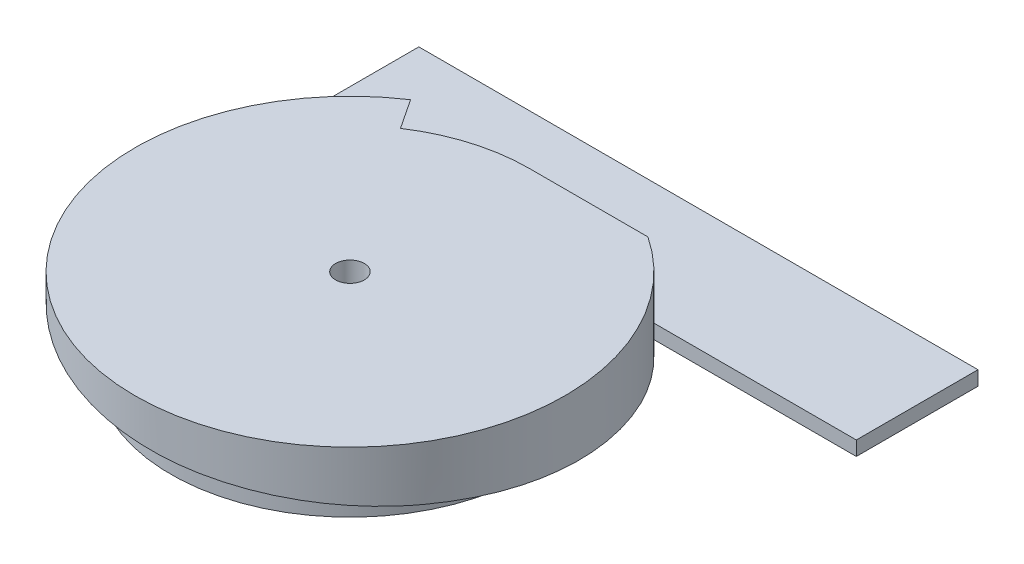
ISO-10303-21;
HEADER;
FILE_DESCRIPTION(('STEP AP214'),'2;1');
FILE_NAME('part.step','',(''),(''),'','','');
FILE_SCHEMA(('AUTOMOTIVE_DESIGN { 1 0 10303 214 1 1 1 1 }'));
ENDSEC;
DATA;
#1=APPLICATION_CONTEXT('core data for automotive mechanical design processes');
#2=APPLICATION_PROTOCOL_DEFINITION('international standard','automotive_design',2000,#1);
#3=PRODUCT_CONTEXT('',#1,'mechanical');
#4=PRODUCT('Part','Part','',(#3));
#5=PRODUCT_RELATED_PRODUCT_CATEGORY('part','',(#4));
#6=PRODUCT_DEFINITION_FORMATION('','',#4);
#7=PRODUCT_DEFINITION_CONTEXT('part definition',#1,'design');
#8=PRODUCT_DEFINITION('design','',#6,#7);
#9=PRODUCT_DEFINITION_SHAPE('','',#8);
#10=(LENGTH_UNIT() NAMED_UNIT(*) SI_UNIT(.MILLI.,.METRE.));
#11=(NAMED_UNIT(*) PLANE_ANGLE_UNIT() SI_UNIT($,.RADIAN.));
#12=(NAMED_UNIT(*) SI_UNIT($,.STERADIAN.) SOLID_ANGLE_UNIT());
#13=UNCERTAINTY_MEASURE_WITH_UNIT(LENGTH_MEASURE(1.E-05),#10,'distance_accuracy_value','');
#14=(GEOMETRIC_REPRESENTATION_CONTEXT(3) GLOBAL_UNCERTAINTY_ASSIGNED_CONTEXT((#13)) GLOBAL_UNIT_ASSIGNED_CONTEXT((#10,
#11,#12)) REPRESENTATION_CONTEXT('',''));
#15=CARTESIAN_POINT('',(0.,0.,0.));
#16=DIRECTION('',(0.,0.,1.));
#17=DIRECTION('',(1.,0.,0.));
#18=AXIS2_PLACEMENT_3D('',#15,#16,#17);
#19=CARTESIAN_POINT('',(-32.3705539105182,2.,-41.98326896183));
#20=DIRECTION('',(1.,0.,0.));
#21=DIRECTION('',(0.,0.,-1.));
#22=AXIS2_PLACEMENT_3D('',#19,#20,#21);
#23=PLANE('',#22);
#24=DIRECTION('',(0.,0.,1.));
#25=VECTOR('',#24,1.);
#26=CARTESIAN_POINT('',(-32.3705539105182,0.,-41.98326896183));
#27=LINE('',#26,#25);
#28=CARTESIAN_POINT('',(-32.3705539105182,0.,-41.98326896183));
#29=VERTEX_POINT('',#28);
#30=CARTESIAN_POINT('',(-32.3705539105182,0.,-25.));
#31=VERTEX_POINT('',#30);
#32=EDGE_CURVE('E114',#29,#31,#27,.T.);
#33=ORIENTED_EDGE('',*,*,#32,.T.);
#34=DIRECTION('',(0.,-1.,0.));
#35=VECTOR('',#34,1.);
#36=CARTESIAN_POINT('',(-32.3705539105182,2.,-25.));
#37=LINE('',#36,#35);
#38=CARTESIAN_POINT('',(-32.3705539105182,2.,-25.));
#39=VERTEX_POINT('',#38);
#40=EDGE_CURVE('E12',#39,#31,#37,.T.);
#41=ORIENTED_EDGE('',*,*,#40,.F.);
#42=DIRECTION('',(0.,0.,1.));
#43=VECTOR('',#42,1.);
#44=CARTESIAN_POINT('',(-32.3705539105182,2.,-41.98326896183));
#45=LINE('',#44,#43);
#46=CARTESIAN_POINT('',(-32.3705539105182,2.,-41.98326896183));
#47=VERTEX_POINT('',#46);
#48=EDGE_CURVE('E102',#47,#39,#45,.T.);
#49=ORIENTED_EDGE('',*,*,#48,.F.);
#50=DIRECTION('',(0.,-1.,0.));
#51=VECTOR('',#50,1.);
#52=CARTESIAN_POINT('',(-32.3705539105182,2.,-41.98326896183));
#53=LINE('',#52,#51);
#54=EDGE_CURVE('E110',#47,#29,#53,.T.);
#55=ORIENTED_EDGE('',*,*,#54,.T.);
#56=EDGE_LOOP('',(#33,#41,#49,#55));
#57=FACE_BOUND('',#56,.T.);
#58=ADVANCED_FACE('F51',(#57),#23,.F.);
#59=CARTESIAN_POINT('',(-32.3705539105182,2.,-25.));
#60=DIRECTION('',(0.,0.,-1.));
#61=DIRECTION('',(-1.,0.,0.));
#62=AXIS2_PLACEMENT_3D('',#59,#60,#61);
#63=PLANE('',#62);
#64=DIRECTION('',(1.,0.,0.));
#65=VECTOR('',#64,1.);
#66=CARTESIAN_POINT('',(-32.3705539105182,0.,-25.));
#67=LINE('',#66,#65);
#68=CARTESIAN_POINT('',(45.6722379603025,0.,-25.));
#69=VERTEX_POINT('',#68);
#70=EDGE_CURVE('E106',#31,#69,#67,.T.);
#71=ORIENTED_EDGE('',*,*,#70,.T.);
#72=DIRECTION('',(0.,-1.,0.));
#73=VECTOR('',#72,1.);
#74=CARTESIAN_POINT('',(45.6722379603025,2.,-25.));
#75=LINE('',#74,#73);
#76=CARTESIAN_POINT('',(45.6722379603025,2.,-25.));
#77=VERTEX_POINT('',#76);
#78=EDGE_CURVE('E59',#77,#69,#75,.T.);
#79=ORIENTED_EDGE('',*,*,#78,.F.);
#80=DIRECTION('',(1.,0.,0.));
#81=VECTOR('',#80,1.);
#82=CARTESIAN_POINT('',(-32.3705539105182,2.,-25.));
#83=LINE('',#82,#81);
#84=EDGE_CURVE('E97',#39,#77,#83,.T.);
#85=ORIENTED_EDGE('',*,*,#84,.F.);
#86=ORIENTED_EDGE('',*,*,#40,.T.);
#87=EDGE_LOOP('',(#71,#79,#85,#86));
#88=FACE_BOUND('',#87,.T.);
#89=ADVANCED_FACE('F105',(#88),#63,.F.);
#90=CARTESIAN_POINT('',(45.6722379603025,2.,-25.));
#91=DIRECTION('',(-1.,0.,0.));
#92=DIRECTION('',(0.,0.,1.));
#93=AXIS2_PLACEMENT_3D('',#90,#91,#92);
#94=PLANE('',#93);
#95=DIRECTION('',(0.,0.,-1.));
#96=VECTOR('',#95,1.);
#97=CARTESIAN_POINT('',(45.6722379603025,0.,-25.));
#98=LINE('',#97,#96);
#99=CARTESIAN_POINT('',(45.6722379603025,0.,-41.98326896183));
#100=VERTEX_POINT('',#99);
#101=EDGE_CURVE('E84',#69,#100,#98,.T.);
#102=ORIENTED_EDGE('',*,*,#101,.T.);
#103=DIRECTION('',(0.,-1.,0.));
#104=VECTOR('',#103,1.);
#105=CARTESIAN_POINT('',(45.6722379603025,2.,-41.98326896183));
#106=LINE('',#105,#104);
#107=CARTESIAN_POINT('',(45.6722379603025,2.,-41.98326896183));
#108=VERTEX_POINT('',#107);
#109=EDGE_CURVE('E107',#108,#100,#106,.T.);
#110=ORIENTED_EDGE('',*,*,#109,.F.);
#111=DIRECTION('',(0.,0.,-1.));
#112=VECTOR('',#111,1.);
#113=CARTESIAN_POINT('',(45.6722379603025,2.,-25.));
#114=LINE('',#113,#112);
#115=EDGE_CURVE('E100',#77,#108,#114,.T.);
#116=ORIENTED_EDGE('',*,*,#115,.F.);
#117=ORIENTED_EDGE('',*,*,#78,.T.);
#118=EDGE_LOOP('',(#102,#110,#116,#117));
#119=FACE_BOUND('',#118,.T.);
#120=ADVANCED_FACE('F108',(#119),#94,.F.);
#121=CARTESIAN_POINT('',(45.6722379603025,2.,-41.98326896183));
#122=DIRECTION('',(0.,0.,1.));
#123=DIRECTION('',(1.,0.,0.));
#124=AXIS2_PLACEMENT_3D('',#121,#122,#123);
#125=PLANE('',#124);
#126=DIRECTION('',(-1.,0.,0.));
#127=VECTOR('',#126,1.);
#128=CARTESIAN_POINT('',(45.6722379603025,0.,-41.98326896183));
#129=LINE('',#128,#127);
#130=EDGE_CURVE('E90',#100,#29,#129,.T.);
#131=ORIENTED_EDGE('',*,*,#130,.T.);
#132=ORIENTED_EDGE('',*,*,#54,.F.);
#133=DIRECTION('',(-1.,0.,0.));
#134=VECTOR('',#133,1.);
#135=CARTESIAN_POINT('',(45.6722379603025,2.,-41.98326896183));
#136=LINE('',#135,#134);
#137=EDGE_CURVE('E67',#108,#47,#136,.T.);
#138=ORIENTED_EDGE('',*,*,#137,.F.);
#139=ORIENTED_EDGE('',*,*,#109,.T.);
#140=EDGE_LOOP('',(#131,#132,#138,#139));
#141=FACE_BOUND('',#140,.T.);
#142=ADVANCED_FACE('F121',(#141),#125,.F.);
#143=CARTESIAN_POINT('',(0.,2.,0.));
#144=DIRECTION('',(0.,1.,0.));
#145=DIRECTION('',(0.,0.,1.));
#146=AXIS2_PLACEMENT_3D('',#143,#144,#145);
#147=PLANE('',#146);
#148=ORIENTED_EDGE('',*,*,#48,.T.);
#149=ORIENTED_EDGE('',*,*,#84,.T.);
#150=ORIENTED_EDGE('',*,*,#115,.T.);
#151=ORIENTED_EDGE('',*,*,#137,.T.);
#152=EDGE_LOOP('',(#148,#149,#150,#151));
#153=FACE_BOUND('',#152,.T.);
#154=ADVANCED_FACE('F98',(#153),#147,.T.);
#155=CARTESIAN_POINT('',(0.,0.,0.));
#156=DIRECTION('',(0.,1.,0.));
#157=DIRECTION('',(0.,0.,1.));
#158=AXIS2_PLACEMENT_3D('',#155,#156,#157);
#159=PLANE('',#158);
#160=ORIENTED_EDGE('',*,*,#32,.F.);
#161=ORIENTED_EDGE('',*,*,#130,.F.);
#162=ORIENTED_EDGE('',*,*,#101,.F.);
#163=ORIENTED_EDGE('',*,*,#70,.F.);
#164=EDGE_LOOP('',(#160,#161,#162,#163));
#165=FACE_BOUND('',#164,.T.);
#166=ADVANCED_FACE('F124',(#165),#159,.F.);
#167=CLOSED_SHELL('',(#58,#89,#120,#142,#154,#166));
#168=MANIFOLD_SOLID_BREP('B2',#167);
#169=CARTESIAN_POINT('',(0.,0.,0.));
#170=DIRECTION('',(0.,1.,0.));
#171=DIRECTION('',(0.,0.,1.));
#172=AXIS2_PLACEMENT_3D('',#169,#170,#171);
#173=PLANE('',#172);
#174=CARTESIAN_POINT('',(0.,0.,0.));
#175=DIRECTION('',(0.,1.,0.));
#176=DIRECTION('',(0.,0.,1.));
#177=AXIS2_PLACEMENT_3D('',#174,#175,#176);
#178=CIRCLE('',#177,2.);
#179=CARTESIAN_POINT('',(0.,0.,2.));
#180=VERTEX_POINT('',#179);
#181=EDGE_CURVE('E306',#180,#180,#178,.T.);
#182=ORIENTED_EDGE('',*,*,#181,.T.);
#183=EDGE_LOOP('',(#182));
#184=FACE_BOUND('',#183,.T.);
#185=CARTESIAN_POINT('',(0.,0.,0.));
#186=DIRECTION('',(0.,1.,0.));
#187=DIRECTION('',(0.,0.,1.));
#188=AXIS2_PLACEMENT_3D('',#185,#186,#187);
#189=CIRCLE('',#188,25.);
#190=CARTESIAN_POINT('',(0.,0.,-25.));
#191=VERTEX_POINT('',#190);
#192=EDGE_CURVE('E237',#191,#191,#189,.T.);
#193=ORIENTED_EDGE('',*,*,#192,.F.);
#194=EDGE_LOOP('',(#193));
#195=FACE_BOUND('',#194,.T.);
#196=ADVANCED_FACE('F175',(#184,#195),#173,.F.);
#197=CARTESIAN_POINT('',(0.,0.,-50.));
#198=CARTESIAN_POINT('',(18.6010420716821,0.75,-50.));
#199=CARTESIAN_POINT('',(32.679286957016,1.5,-37.8426241687995));
#200=CARTESIAN_POINT('',(46.7575318423499,2.25,-25.685248337599));
#201=CARTESIAN_POINT('',(49.4667989767483,3.,-7.28256815924024));
#202=CARTESIAN_POINT('',(52.1760661111467,3.75,11.1201120191185));
#203=CARTESIAN_POINT('',(42.1988523434095,4.5,26.8189645754477));
#204=CARTESIAN_POINT('',(32.2216385756724,5.25,42.517817131777));
#205=CARTESIAN_POINT('',(14.4098134067042,6.,47.8785680402408));
#206=CARTESIAN_POINT('',(-3.40201176226411,6.75,53.2393189487047));
#207=CARTESIAN_POINT('',(-20.3866462197122,7.5,45.6550616680374));
#208=CARTESIAN_POINT('',(-37.3712806771603,8.25,38.0708043873701));
#209=CARTESIAN_POINT('',(-45.269181044898,9.,21.2297255640352));
#210=CARTESIAN_POINT('',(-53.1670814126357,9.75,4.3886467407004));
#211=CARTESIAN_POINT('',(-48.1375379687444,10.5,-13.5195206389758));
#212=CARTESIAN_POINT('',(-43.1079945248531,11.25,-31.427688018652));
#213=CARTESIAN_POINT('',(-27.5968492656024,12.,-41.6942911033588));
#214=CARTESIAN_POINT('',(0.,0.,0.));
#215=CARTESIAN_POINT('',(0.,0.75,0.));
#216=CARTESIAN_POINT('',(0.,1.5,0.));
#217=CARTESIAN_POINT('',(0.,2.25,0.));
#218=CARTESIAN_POINT('',(0.,3.,0.));
#219=CARTESIAN_POINT('',(0.,3.75,0.));
#220=CARTESIAN_POINT('',(0.,4.5,0.));
#221=CARTESIAN_POINT('',(0.,5.25,0.));
#222=CARTESIAN_POINT('',(0.,6.,0.));
#223=CARTESIAN_POINT('',(0.,6.75,0.));
#224=CARTESIAN_POINT('',(0.,7.5,0.));
#225=CARTESIAN_POINT('',(0.,8.25,0.));
#226=CARTESIAN_POINT('',(0.,9.,0.));
#227=CARTESIAN_POINT('',(0.,9.75,0.));
#228=CARTESIAN_POINT('',(0.,10.5,0.));
#229=CARTESIAN_POINT('',(0.,11.25,0.));
#230=CARTESIAN_POINT('',(0.,12.,0.));
#231=(BOUNDED_SURFACE() B_SPLINE_SURFACE(1,2,((#197,#198,#199,#200,#201,#202,#203,#204,#205,
#206,#207,#208,#209,#210,#211,#212,#213),(#214,#215,#216,#217,#218,#219,#220,#221,#222,#223,
#224,#225,#226,#227,#228,#229,#230)),.UNSPECIFIED.,.F.,.F.,.F.) B_SPLINE_SURFACE_WITH_KNOTS((2,
2),(3,2,2,2,2,2,2,2,3),(0.,1.),(0.,0.125,0.25,0.375,0.5,0.625,0.75,0.875,1.),
.UNSPECIFIED.) GEOMETRIC_REPRESENTATION_ITEM() RATIONAL_B_SPLINE_SURFACE(((1.,0.937243960603638,
1.,0.937243960603638,1.,0.937243960603638,1.,0.937243960603638,1.,0.937243960603638,1.,
0.937243960603638,1.,0.937243960603638,1.,0.937243960603638,1.),(1.,0.937243960603638,1.,
0.937243960603638,1.,0.937243960603638,1.,0.937243960603638,1.,0.937243960603638,1.,
0.937243960603638,1.,0.937243960603638,1.,0.937243960603638,1.))) REPRESENTATION_ITEM('') SURFACE());
#232=CARTESIAN_POINT('',(0.,0.,-25.));
#233=CARTESIAN_POINT('',(9.30052103584105,0.75,-25.));
#234=CARTESIAN_POINT('',(16.339643478508,1.5,-18.9213120843997));
#235=CARTESIAN_POINT('',(23.3787659211749,2.25,-12.8426241687995));
#236=CARTESIAN_POINT('',(24.7333994883741,3.,-3.64128407962012));
#237=CARTESIAN_POINT('',(26.0880330555733,3.75,5.56005600955924));
#238=CARTESIAN_POINT('',(21.0994261717048,4.5,13.4094822877239));
#239=CARTESIAN_POINT('',(16.1108192878362,5.25,21.2589085658885));
#240=CARTESIAN_POINT('',(7.20490670335208,6.,23.9392840201204));
#241=CARTESIAN_POINT('',(-1.70100588113205,6.75,26.6196594743523));
#242=CARTESIAN_POINT('',(-10.1933231098561,7.5,22.8275308340187));
#243=CARTESIAN_POINT('',(-18.6856403385801,8.25,19.035402193685));
#244=CARTESIAN_POINT('',(-22.634590522449,9.,10.6148627820176));
#245=CARTESIAN_POINT('',(-26.5835407063178,9.75,2.1943233703502));
#246=CARTESIAN_POINT('',(-24.0687689843722,10.5,-6.75976031948791));
#247=CARTESIAN_POINT('',(-21.5539972624266,11.25,-15.713844009326));
#248=CARTESIAN_POINT('',(-13.7984246328012,12.,-20.8471455516794));
#249=(BOUNDED_CURVE() B_SPLINE_CURVE(2,(#232,#233,#234,#235,#236,#237,#238,#239,#240,#241,#242,
#243,#244,#245,#246,#247,#248),.UNSPECIFIED.,.F.,.F.) B_SPLINE_CURVE_WITH_KNOTS((3,2,2,2,2,2,2,
2,3),(0.,0.125,0.25,0.375,0.5,0.625,0.75,0.875,1.),
.UNSPECIFIED.) CURVE() GEOMETRIC_REPRESENTATION_ITEM() RATIONAL_B_SPLINE_CURVE((1.,
0.937243960603638,1.,0.937243960603638,1.,0.937243960603638,1.,0.937243960603638,1.,
0.937243960603638,1.,0.937243960603638,1.,0.937243960603638,1.,0.937243960603638,1.)) REPRESENTATION_ITEM(''));
#250=CARTESIAN_POINT('',(-13.7984246328012,12.,-20.8471455516794));
#251=VERTEX_POINT('',#250);
#252=EDGE_CURVE('E49',#191,#251,#249,.T.);
#253=CARTESIAN_POINT('',(0.,0.,-25.));
#254=CARTESIAN_POINT('',(0.690684168935206,0.055699596492496,-25.));
#255=CARTESIAN_POINT('',(1.38129829315761,0.11225129023277,-25.));
#256=CARTESIAN_POINT('',(2.76246919042732,0.225887975624314,-25.));
#257=CARTESIAN_POINT('',(3.45302596433333,0.282972956802437,-25.));
#258=CARTESIAN_POINT('',(4.83417749499595,0.396506406027039,-25.));
#259=CARTESIAN_POINT('',(5.52477225065366,0.452954887384003,-25.));
#260=CARTESIAN_POINT('',(6.90608476059046,0.564176840968028,-25.));
#261=CARTESIAN_POINT('',(7.59680251239538,0.618950343738754,-25.));
#262=CARTESIAN_POINT('',(8.97844954480829,0.725986954480082,-25.));
#263=CARTESIAN_POINT('',(9.66937882996569,0.778250003987769,-25.));
#264=CARTESIAN_POINT('',(11.0514651113364,0.879668629300601,-25.));
#265=CARTESIAN_POINT('',(11.742622107205,0.928824209787756,-25.));
#266=CARTESIAN_POINT('',(13.1251884946397,1.02365765103299,-25.));
#267=CARTESIAN_POINT('',(13.8165978908204,1.06933544463931,-25.));
#268=CARTESIAN_POINT('',(15.1996765853995,1.15709386336779,-25.));
#269=CARTESIAN_POINT('',(15.89134589424,1.1991743238462,-25.));
#270=CARTESIAN_POINT('',(16.583123951777,1.23939482045356,-25.));
#271=B_SPLINE_CURVE_WITH_KNOTS('',3,(#253,#254,#255,#256,#257,#258,#259,#260,#261,#262,#263,
#264,#265,#266,#267,#268,#269,#270),.UNSPECIFIED.,.F.,.F.,(4,2,2,2,2,2,2,2,4),(0.,
2.0787772871432,4.15751383497882,6.23620683135019,8.31486189958945,10.3935653516716,
12.4722656717051,14.5510061186887,16.6298416551587),.UNSPECIFIED.);
#272=CARTESIAN_POINT('',(16.583123951777,1.23939482045356,-25.));
#273=VERTEX_POINT('',#272);
#274=EDGE_CURVE('E255',#191,#273,#271,.T.);
#275=CARTESIAN_POINT('',(0.,0.,-30.));
#276=CARTESIAN_POINT('',(11.1606252430093,0.75,-30.));
#277=CARTESIAN_POINT('',(19.6075721742096,1.5,-22.7055745012797));
#278=CARTESIAN_POINT('',(28.0545191054099,2.25,-15.4111490025594));
#279=CARTESIAN_POINT('',(29.6800793860489,3.,-4.36954089554414));
#280=CARTESIAN_POINT('',(31.305639666688,3.75,6.67206721147109));
#281=CARTESIAN_POINT('',(25.3193114060457,4.5,16.0913787452686));
#282=CARTESIAN_POINT('',(19.3329831454035,5.25,25.5106902790662));
#283=CARTESIAN_POINT('',(8.6458880440225,6.,28.7271408241445));
#284=CARTESIAN_POINT('',(-2.04120705735846,6.75,31.9435913692228));
#285=CARTESIAN_POINT('',(-12.2319877318273,7.5,27.3930370008224));
#286=CARTESIAN_POINT('',(-22.4227684062962,8.25,22.842482632422));
#287=CARTESIAN_POINT('',(-27.1615086269388,9.,12.7378353384211));
#288=CARTESIAN_POINT('',(-31.9002488475814,9.75,2.63318804442024));
#289=CARTESIAN_POINT('',(-28.8825227812466,10.5,-8.11171238338549));
#290=CARTESIAN_POINT('',(-25.8647967149119,11.25,-18.8566128111912));
#291=CARTESIAN_POINT('',(-16.5581095593614,12.,-25.0165746620153));
#292=(BOUNDED_CURVE() B_SPLINE_CURVE(2,(#275,#276,#277,#278,#279,#280,#281,#282,#283,#284,#285,
#286,#287,#288,#289,#290,#291),.UNSPECIFIED.,.F.,.F.) B_SPLINE_CURVE_WITH_KNOTS((3,2,2,2,2,2,2,
2,3),(0.,0.125,0.25,0.375,0.5,0.625,0.75,0.875,1.),
.UNSPECIFIED.) CURVE() GEOMETRIC_REPRESENTATION_ITEM() RATIONAL_B_SPLINE_CURVE((1.,
0.937243960603638,1.,0.937243960603638,1.,0.937243960603638,1.,0.937243960603638,1.,
0.937243960603638,1.,0.937243960603638,1.,0.937243960603638,1.,0.937243960603638,1.)) REPRESENTATION_ITEM(''));
#293=CARTESIAN_POINT('',(-16.583123951777,11.9979831170823,-25.));
#294=VERTEX_POINT('',#293);
#295=EDGE_CURVE('E223',#273,#294,#292,.T.);
#296=CARTESIAN_POINT('',(-16.583123951777,11.9979831170823,-25.));
#297=CARTESIAN_POINT('',(-16.5711289778153,11.9986554113882,-25.));
#298=CARTESIAN_POINT('',(-16.5591340038536,11.9993277056941,-25.));
#299=CARTESIAN_POINT('',(-16.5471390298918,12.,-25.));
#300=B_SPLINE_CURVE_WITH_KNOTS('',3,(#296,#297,#298,#299),.UNSPECIFIED.,.F.,.F.,(4,4),(0.,
0.0360413986935135),.UNSPECIFIED.);
#301=CARTESIAN_POINT('',(-16.5471390298918,12.,-25.));
#302=VERTEX_POINT('',#301);
#303=EDGE_CURVE('E220',#294,#302,#300,.T.);
#304=DIRECTION('',(0.551936985312047,0.,0.833885822067175));
#305=VECTOR('',#304,1.);
#306=CARTESIAN_POINT('',(0.,12.,0.));
#307=LINE('',#306,#305);
#308=EDGE_CURVE('E179',#302,#251,#307,.T.);
#309=ORIENTED_EDGE('',*,*,#252,.F.);
#310=ORIENTED_EDGE('',*,*,#274,.T.);
#311=ORIENTED_EDGE('',*,*,#295,.T.);
#312=ORIENTED_EDGE('',*,*,#303,.T.);
#313=ORIENTED_EDGE('',*,*,#308,.T.);
#314=EDGE_LOOP('',(#309,#310,#311,#312,#313));
#315=FACE_BOUND('',#314,.T.);
#316=ADVANCED_FACE('F221',(#315),#231,.F.);
#317=CARTESIAN_POINT('',(0.,12.,0.));
#318=DIRECTION('',(0.,-1.,0.));
#319=DIRECTION('',(0.,0.,-1.));
#320=AXIS2_PLACEMENT_3D('',#317,#318,#319);
#321=CYLINDRICAL_SURFACE('',#320,30.);
#322=ORIENTED_EDGE('',*,*,#295,.F.);
#323=DIRECTION('',(0.,-1.,0.));
#324=VECTOR('',#323,1.);
#325=CARTESIAN_POINT('',(16.583123951777,12.,-25.));
#326=LINE('',#325,#324);
#327=CARTESIAN_POINT('',(16.583123951777,12.,-25.));
#328=VERTEX_POINT('',#327);
#329=EDGE_CURVE('E186',#328,#273,#326,.T.);
#330=ORIENTED_EDGE('',*,*,#329,.F.);
#331=CARTESIAN_POINT('',(0.,12.,0.));
#332=DIRECTION('',(0.,1.,0.));
#333=DIRECTION('',(0.,0.,1.));
#334=AXIS2_PLACEMENT_3D('',#331,#332,#333);
#335=CIRCLE('',#334,30.);
#336=CARTESIAN_POINT('',(-16.583123951777,12.,-25.));
#337=VERTEX_POINT('',#336);
#338=EDGE_CURVE('E247',#337,#328,#335,.T.);
#339=ORIENTED_EDGE('',*,*,#338,.F.);
#340=DIRECTION('',(0.,-1.,0.));
#341=VECTOR('',#340,1.);
#342=CARTESIAN_POINT('',(-16.583123951777,12.,-25.));
#343=LINE('',#342,#341);
#344=EDGE_CURVE('E241',#337,#294,#343,.T.);
#345=ORIENTED_EDGE('',*,*,#344,.T.);
#346=EDGE_LOOP('',(#322,#330,#339,#345));
#347=FACE_BOUND('',#346,.T.);
#348=ADVANCED_FACE('F177',(#347),#321,.T.);
#349=CARTESIAN_POINT('',(-16.583123951777,12.,-25.));
#350=DIRECTION('',(0.,0.,-1.));
#351=DIRECTION('',(-1.,0.,0.));
#352=AXIS2_PLACEMENT_3D('',#349,#350,#351);
#353=PLANE('',#352);
#354=DIRECTION('',(0.,-1.,0.));
#355=VECTOR('',#354,1.);
#356=CARTESIAN_POINT('',(0.,12.051,-25.));
#357=LINE('',#356,#355);
#358=CARTESIAN_POINT('',(0.,12.,-25.));
#359=VERTEX_POINT('',#358);
#360=EDGE_CURVE('E195',#359,#191,#357,.T.);
#361=ORIENTED_EDGE('',*,*,#360,.F.);
#362=DIRECTION('',(1.,0.,0.));
#363=VECTOR('',#362,1.);
#364=CARTESIAN_POINT('',(-16.583123951777,12.,-25.));
#365=LINE('',#364,#363);
#366=EDGE_CURVE('E243',#359,#328,#365,.T.);
#367=ORIENTED_EDGE('',*,*,#366,.T.);
#368=ORIENTED_EDGE('',*,*,#329,.T.);
#369=ORIENTED_EDGE('',*,*,#274,.F.);
#370=EDGE_LOOP('',(#361,#367,#368,#369));
#371=FACE_BOUND('',#370,.T.);
#372=ADVANCED_FACE('F322',(#371),#353,.T.);
#373=ORIENTED_EDGE('',*,*,#303,.F.);
#374=ORIENTED_EDGE('',*,*,#344,.F.);
#375=EDGE_CURVE('E234',#337,#302,#365,.T.);
#376=ORIENTED_EDGE('',*,*,#375,.T.);
#377=EDGE_LOOP('',(#373,#374,#376));
#378=FACE_BOUND('',#377,.T.);
#379=ADVANCED_FACE('F240',(#378),#353,.T.);
#380=CARTESIAN_POINT('',(0.,12.,0.));
#381=DIRECTION('',(0.,1.,0.));
#382=DIRECTION('',(0.,0.,1.));
#383=AXIS2_PLACEMENT_3D('',#380,#381,#382);
#384=PLANE('',#383);
#385=CARTESIAN_POINT('',(0.,12.,0.));
#386=DIRECTION('',(0.,1.,0.));
#387=DIRECTION('',(0.,0.,1.));
#388=AXIS2_PLACEMENT_3D('',#385,#386,#387);
#389=CIRCLE('',#388,2.);
#390=CARTESIAN_POINT('',(0.,12.,2.));
#391=VERTEX_POINT('',#390);
#392=EDGE_CURVE('E309',#391,#391,#389,.T.);
#393=ORIENTED_EDGE('',*,*,#392,.F.);
#394=EDGE_LOOP('',(#393));
#395=FACE_BOUND('',#394,.T.);
#396=ORIENTED_EDGE('',*,*,#366,.F.);
#397=CARTESIAN_POINT('',(0.,12.,0.));
#398=DIRECTION('',(0.,1.,0.));
#399=DIRECTION('',(0.,0.,1.));
#400=AXIS2_PLACEMENT_3D('',#397,#398,#399);
#401=CIRCLE('',#400,25.);
#402=EDGE_CURVE('E236',#359,#251,#401,.T.);
#403=ORIENTED_EDGE('',*,*,#402,.T.);
#404=ORIENTED_EDGE('',*,*,#308,.F.);
#405=ORIENTED_EDGE('',*,*,#375,.F.);
#406=ORIENTED_EDGE('',*,*,#338,.T.);
#407=EDGE_LOOP('',(#396,#403,#404,#405,#406));
#408=FACE_BOUND('',#407,.T.);
#409=ADVANCED_FACE('F232',(#395,#408),#384,.T.);
#410=CARTESIAN_POINT('',(0.,0.,0.));
#411=DIRECTION('',(0.,1.,0.));
#412=DIRECTION('',(0.,0.,1.));
#413=AXIS2_PLACEMENT_3D('',#410,#411,#412);
#414=CYLINDRICAL_SURFACE('',#413,25.);
#415=ORIENTED_EDGE('',*,*,#402,.F.);
#416=ORIENTED_EDGE('',*,*,#360,.T.);
#417=ORIENTED_EDGE('',*,*,#192,.T.);
#418=ORIENTED_EDGE('',*,*,#252,.T.);
#419=EDGE_LOOP('',(#415,#416,#417,#418));
#420=FACE_BOUND('',#419,.T.);
#421=ADVANCED_FACE('F272',(#420),#414,.T.);
#422=CARTESIAN_POINT('',(0.,-0.0100000000000083,0.));
#423=DIRECTION('',(0.,1.,0.));
#424=DIRECTION('',(0.,0.,1.));
#425=AXIS2_PLACEMENT_3D('',#422,#423,#424);
#426=CYLINDRICAL_SURFACE('',#425,2.);
#427=CARTESIAN_POINT('',(0.,12.,2.));
#428=CARTESIAN_POINT('',(0.,11.875,2.));
#429=CARTESIAN_POINT('',(0.,11.75,2.));
#430=CARTESIAN_POINT('',(0.,11.5,2.));
#431=CARTESIAN_POINT('',(0.,11.375,2.));
#432=CARTESIAN_POINT('',(0.,11.125,2.));
#433=CARTESIAN_POINT('',(0.,11.,2.));
#434=CARTESIAN_POINT('',(0.,10.75,2.));
#435=CARTESIAN_POINT('',(0.,10.625,2.));
#436=CARTESIAN_POINT('',(0.,10.375,2.));
#437=CARTESIAN_POINT('',(0.,10.25,2.));
#438=CARTESIAN_POINT('',(0.,10.,2.));
#439=CARTESIAN_POINT('',(0.,9.875,2.));
#440=CARTESIAN_POINT('',(0.,9.625,2.));
#441=CARTESIAN_POINT('',(0.,9.5,2.));
#442=CARTESIAN_POINT('',(0.,9.25,2.));
#443=CARTESIAN_POINT('',(0.,9.125,2.));
#444=CARTESIAN_POINT('',(0.,8.875,2.));
#445=CARTESIAN_POINT('',(0.,8.75,2.));
#446=CARTESIAN_POINT('',(0.,8.5,2.));
#447=CARTESIAN_POINT('',(0.,8.375,2.));
#448=CARTESIAN_POINT('',(0.,8.125,2.));
#449=CARTESIAN_POINT('',(0.,8.,2.));
#450=CARTESIAN_POINT('',(0.,7.75,2.));
#451=CARTESIAN_POINT('',(0.,7.625,2.));
#452=CARTESIAN_POINT('',(0.,7.375,2.));
#453=CARTESIAN_POINT('',(0.,7.25,2.));
#454=CARTESIAN_POINT('',(0.,7.,2.));
#455=CARTESIAN_POINT('',(0.,6.875,2.));
#456=CARTESIAN_POINT('',(0.,6.625,2.));
#457=CARTESIAN_POINT('',(0.,6.5,2.));
#458=CARTESIAN_POINT('',(0.,6.25,2.));
#459=CARTESIAN_POINT('',(0.,6.125,2.));
#460=CARTESIAN_POINT('',(0.,5.875,2.));
#461=CARTESIAN_POINT('',(0.,5.75,2.));
#462=CARTESIAN_POINT('',(0.,5.5,2.));
#463=CARTESIAN_POINT('',(0.,5.375,2.));
#464=CARTESIAN_POINT('',(0.,5.125,2.));
#465=CARTESIAN_POINT('',(0.,5.,2.));
#466=CARTESIAN_POINT('',(0.,4.75,2.));
#467=CARTESIAN_POINT('',(0.,4.625,2.));
#468=CARTESIAN_POINT('',(0.,4.375,2.));
#469=CARTESIAN_POINT('',(0.,4.25,2.));
#470=CARTESIAN_POINT('',(0.,4.,2.));
#471=CARTESIAN_POINT('',(0.,3.875,2.));
#472=CARTESIAN_POINT('',(0.,3.625,2.));
#473=CARTESIAN_POINT('',(0.,3.5,2.));
#474=CARTESIAN_POINT('',(0.,3.25,2.));
#475=CARTESIAN_POINT('',(0.,3.125,2.));
#476=CARTESIAN_POINT('',(0.,2.875,2.));
#477=CARTESIAN_POINT('',(0.,2.75,2.));
#478=CARTESIAN_POINT('',(0.,2.5,2.));
#479=CARTESIAN_POINT('',(0.,2.375,2.));
#480=CARTESIAN_POINT('',(0.,2.125,2.));
#481=CARTESIAN_POINT('',(0.,2.,2.));
#482=CARTESIAN_POINT('',(0.,1.75,2.));
#483=CARTESIAN_POINT('',(0.,1.625,2.));
#484=CARTESIAN_POINT('',(0.,1.375,2.));
#485=CARTESIAN_POINT('',(0.,1.25,2.));
#486=CARTESIAN_POINT('',(0.,1.,2.));
#487=CARTESIAN_POINT('',(0.,0.875000000000001,2.));
#488=CARTESIAN_POINT('',(0.,0.625000000000001,2.));
#489=CARTESIAN_POINT('',(0.,0.5,2.));
#490=CARTESIAN_POINT('',(0.,0.25,2.));
#491=CARTESIAN_POINT('',(0.,0.125,2.));
#492=CARTESIAN_POINT('',(0.,0.,2.));
#493=B_SPLINE_CURVE_WITH_KNOTS('',3,(#427,#428,#429,#430,#431,#432,#433,#434,#435,#436,#437,
#438,#439,#440,#441,#442,#443,#444,#445,#446,#447,#448,#449,#450,#451,#452,#453,#454,#455,#456,
#457,#458,#459,#460,#461,#462,#463,#464,#465,#466,#467,#468,#469,#470,#471,#472,#473,#474,#475,
#476,#477,#478,#479,#480,#481,#482,#483,#484,#485,#486,#487,#488,#489,#490,#491,#492),
.UNSPECIFIED.,.F.,.F.,(4,2,2,2,2,2,2,2,2,2,2,2,2,2,2,2,2,2,2,2,2,2,2,2,2,2,2,2,2,2,2,2,4),(0.,
0.375,0.750000000000001,1.125,1.5,1.875,2.25,2.625,3.,3.375,3.75,4.125,4.5,4.875,5.25,5.625,6.,
6.375,6.75,7.125,7.5,7.875,8.25,8.625,9.,9.375,9.75,10.125,10.5,10.875,11.25,11.625,12.),.UNSPECIFIED.);
#494=EDGE_CURVE('BSEAM313',#391,#180,#493,.T.);
#495=ORIENTED_EDGE('',*,*,#392,.T.);
#496=ORIENTED_EDGE('',*,*,#181,.F.);
#497=ORIENTED_EDGE('',*,*,#494,.T.);
#498=ORIENTED_EDGE('',*,*,#494,.F.);
#499=EDGE_LOOP('',(#495,#497,#496,#498));
#500=FACE_BOUND('',#499,.T.);
#501=ADVANCED_FACE('F313',(#500),#426,.F.);
#502=CLOSED_SHELL('',(#196,#316,#348,#372,#379,#409,#421,#501));
#503=MANIFOLD_SOLID_BREP('B6',#502);
#504=ADVANCED_BREP_SHAPE_REPRESENTATION('',(#18,#168,#503),#14);
#505=SHAPE_DEFINITION_REPRESENTATION(#9,#504);
ENDSEC;
END-ISO-10303-21;
